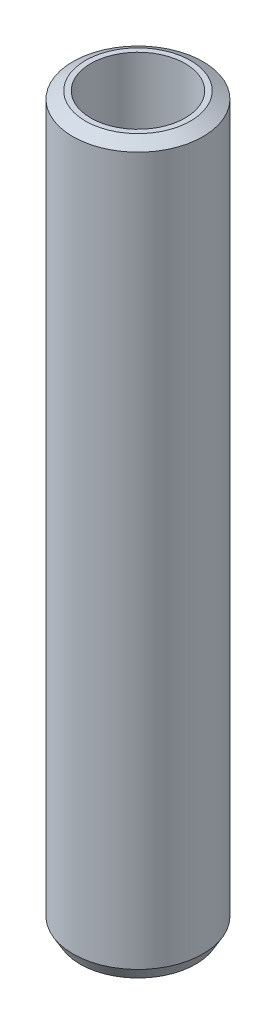
ISO-10303-21;
HEADER;
FILE_DESCRIPTION(('STEP AP214'),'2;1');
FILE_NAME('part.step','',(''),(''),'','','');
FILE_SCHEMA(('AUTOMOTIVE_DESIGN { 1 0 10303 214 1 1 1 1 }'));
ENDSEC;
DATA;
#1=APPLICATION_CONTEXT('core data for automotive mechanical design processes');
#2=APPLICATION_PROTOCOL_DEFINITION('international standard','automotive_design',2000,#1);
#3=PRODUCT_CONTEXT('',#1,'mechanical');
#4=PRODUCT('Part','Part','',(#3));
#5=PRODUCT_RELATED_PRODUCT_CATEGORY('part','',(#4));
#6=PRODUCT_DEFINITION_FORMATION('','',#4);
#7=PRODUCT_DEFINITION_CONTEXT('part definition',#1,'design');
#8=PRODUCT_DEFINITION('design','',#6,#7);
#9=PRODUCT_DEFINITION_SHAPE('','',#8);
#10=(LENGTH_UNIT() NAMED_UNIT(*) SI_UNIT(.MILLI.,.METRE.));
#11=(NAMED_UNIT(*) PLANE_ANGLE_UNIT() SI_UNIT($,.RADIAN.));
#12=(NAMED_UNIT(*) SI_UNIT($,.STERADIAN.) SOLID_ANGLE_UNIT());
#13=UNCERTAINTY_MEASURE_WITH_UNIT(LENGTH_MEASURE(1.E-05),#10,'distance_accuracy_value','');
#14=(GEOMETRIC_REPRESENTATION_CONTEXT(3) GLOBAL_UNCERTAINTY_ASSIGNED_CONTEXT((#13)) GLOBAL_UNIT_ASSIGNED_CONTEXT((#10,
#11,#12)) REPRESENTATION_CONTEXT('',''));
#15=CARTESIAN_POINT('',(0.,0.,0.));
#16=DIRECTION('',(0.,0.,1.));
#17=DIRECTION('',(1.,0.,0.));
#18=AXIS2_PLACEMENT_3D('',#15,#16,#17);
#19=CARTESIAN_POINT('',(0.,559.12420559605,0.));
#20=DIRECTION('',(0.,-1.,0.));
#21=DIRECTION('',(0.,0.,-1.));
#22=AXIS2_PLACEMENT_3D('',#19,#20,#21);
#23=CYLINDRICAL_SURFACE('',#22,50.);
#24=CARTESIAN_POINT('',(0.,553.564110897413,0.));
#25=DIRECTION('',(0.,1.,0.));
#26=DIRECTION('',(0.,0.,1.));
#27=AXIS2_PLACEMENT_3D('',#24,#25,#26);
#28=CIRCLE('',#27,50.);
#29=CARTESIAN_POINT('',(0.,553.564110897413,50.));
#30=VERTEX_POINT('',#29);
#31=EDGE_CURVE('E50',#30,#30,#28,.F.);
#32=ORIENTED_EDGE('',*,*,#31,.T.);
#33=EDGE_LOOP('',(#32));
#34=FACE_BOUND('',#33,.T.);
#35=CARTESIAN_POINT('',(0.,9.63036651293303,0.));
#36=DIRECTION('',(0.,1.,0.));
#37=DIRECTION('',(0.,0.,1.));
#38=AXIS2_PLACEMENT_3D('',#35,#36,#37);
#39=CIRCLE('',#38,50.);
#40=CARTESIAN_POINT('',(0.,9.63036651293303,50.));
#41=VERTEX_POINT('',#40);
#42=EDGE_CURVE('E51',#41,#41,#39,.T.);
#43=ORIENTED_EDGE('',*,*,#42,.T.);
#44=EDGE_LOOP('',(#43));
#45=FACE_BOUND('',#44,.T.);
#46=ADVANCED_FACE('F39',(#34,#45),#23,.T.);
#47=CARTESIAN_POINT('',(0.,559.12420559605,0.));
#48=DIRECTION('',(0.,1.,0.));
#49=DIRECTION('',(0.,0.,1.));
#50=AXIS2_PLACEMENT_3D('',#47,#48,#49);
#51=PLANE('',#50);
#52=CARTESIAN_POINT('',(0.,559.12420559605,0.));
#53=DIRECTION('',(0.,1.,0.));
#54=DIRECTION('',(0.,0.,1.));
#55=AXIS2_PLACEMENT_3D('',#52,#53,#54);
#56=CIRCLE('',#55,40.3696334870667);
#57=CARTESIAN_POINT('',(0.,559.12420559605,40.3696334870667));
#58=VERTEX_POINT('',#57);
#59=EDGE_CURVE('E54',#58,#58,#56,.T.);
#60=ORIENTED_EDGE('',*,*,#59,.T.);
#61=EDGE_LOOP('',(#60));
#62=FACE_BOUND('',#61,.T.);
#63=CARTESIAN_POINT('',(0.,559.12420559605,0.));
#64=DIRECTION('',(0.,1.,0.));
#65=DIRECTION('',(0.,0.,1.));
#66=AXIS2_PLACEMENT_3D('',#63,#64,#65);
#67=CIRCLE('',#66,36.2844619087032);
#68=CARTESIAN_POINT('',(0.,559.12420559605,36.2844619087032));
#69=VERTEX_POINT('',#68);
#70=EDGE_CURVE('E58',#69,#69,#67,.T.);
#71=ORIENTED_EDGE('',*,*,#70,.F.);
#72=EDGE_LOOP('',(#71));
#73=FACE_BOUND('',#72,.T.);
#74=ADVANCED_FACE('F69',(#62,#73),#51,.T.);
#75=CARTESIAN_POINT('',(0.,0.,0.));
#76=DIRECTION('',(0.,1.,0.));
#77=DIRECTION('',(0.,0.,1.));
#78=AXIS2_PLACEMENT_3D('',#75,#76,#77);
#79=PLANE('',#78);
#80=CARTESIAN_POINT('',(0.,0.,0.));
#81=DIRECTION('',(0.,1.,0.));
#82=DIRECTION('',(0.,0.,1.));
#83=AXIS2_PLACEMENT_3D('',#80,#81,#82);
#84=CIRCLE('',#83,44.4399053013633);
#85=CARTESIAN_POINT('',(0.,0.,44.4399053013633));
#86=VERTEX_POINT('',#85);
#87=EDGE_CURVE('E10',#86,#86,#84,.F.);
#88=ORIENTED_EDGE('',*,*,#87,.T.);
#89=EDGE_LOOP('',(#88));
#90=FACE_BOUND('',#89,.T.);
#91=CARTESIAN_POINT('',(0.,0.,0.));
#92=DIRECTION('',(0.,1.,0.));
#93=DIRECTION('',(0.,0.,1.));
#94=AXIS2_PLACEMENT_3D('',#91,#92,#93);
#95=CIRCLE('',#94,36.2844619087032);
#96=CARTESIAN_POINT('',(0.,0.,36.2844619087032));
#97=VERTEX_POINT('',#96);
#98=EDGE_CURVE('E63',#97,#97,#95,.T.);
#99=ORIENTED_EDGE('',*,*,#98,.T.);
#100=EDGE_LOOP('',(#99));
#101=FACE_BOUND('',#100,.T.);
#102=ADVANCED_FACE('F75',(#90,#101),#79,.F.);
#103=CARTESIAN_POINT('',(0.,559.12420559605,0.));
#104=DIRECTION('',(0.,-1.,0.));
#105=DIRECTION('',(0.,0.,-1.));
#106=AXIS2_PLACEMENT_3D('',#103,#104,#105);
#107=CYLINDRICAL_SURFACE('',#106,36.2844619087032);
#108=ORIENTED_EDGE('',*,*,#70,.T.);
#109=EDGE_LOOP('',(#108));
#110=FACE_BOUND('',#109,.T.);
#111=ORIENTED_EDGE('',*,*,#98,.F.);
#112=EDGE_LOOP('',(#111));
#113=FACE_BOUND('',#112,.T.);
#114=ADVANCED_FACE('F70',(#110,#113),#107,.F.);
#115=CARTESIAN_POINT('',(0.,559.12420559605,0.));
#116=DIRECTION('',(0.,-1.,0.));
#117=DIRECTION('',(0.,0.,-1.));
#118=AXIS2_PLACEMENT_3D('',#115,#116,#117);
#119=CONICAL_SURFACE('',#118,40.3696334870667,1.04719755119659);
#120=ORIENTED_EDGE('',*,*,#31,.F.);
#121=EDGE_LOOP('',(#120));
#122=FACE_BOUND('',#121,.T.);
#123=ORIENTED_EDGE('',*,*,#59,.F.);
#124=EDGE_LOOP('',(#123));
#125=FACE_BOUND('',#124,.T.);
#126=ADVANCED_FACE('F81',(#122,#125),#119,.T.);
#127=CARTESIAN_POINT('',(0.,9.63036651293303,0.));
#128=DIRECTION('',(0.,1.,0.));
#129=DIRECTION('',(0.,0.,1.));
#130=AXIS2_PLACEMENT_3D('',#127,#128,#129);
#131=CONICAL_SURFACE('',#130,50.,0.523598775598306);
#132=CARTESIAN_POINT('',(0.,0.,44.4399053013633));
#133=CARTESIAN_POINT('',(0.,0.100316317843051,44.4978229544741));
#134=CARTESIAN_POINT('',(0.,0.200632635686103,44.5557406075849));
#135=CARTESIAN_POINT('',(0.,0.401265271372208,44.6715759138065));
#136=CARTESIAN_POINT('',(0.,0.50158158921526,44.7294935669173));
#137=CARTESIAN_POINT('',(0.,0.702214224901365,44.8453288731389));
#138=CARTESIAN_POINT('',(0.,0.802530542744417,44.9032465262497));
#139=CARTESIAN_POINT('',(0.,1.00316317843052,45.0190818324713));
#140=CARTESIAN_POINT('',(0.,1.10347949627357,45.0769994855821));
#141=CARTESIAN_POINT('',(0.,1.30411213195968,45.1928347918037));
#142=CARTESIAN_POINT('',(0.,1.40442844980273,45.2507524449145));
#143=CARTESIAN_POINT('',(0.,1.60506108548884,45.3665877511361));
#144=CARTESIAN_POINT('',(0.,1.70537740333189,45.4245054042469));
#145=CARTESIAN_POINT('',(0.,1.90601003901799,45.5403407104685));
#146=CARTESIAN_POINT('',(0.,2.00632635686105,45.5982583635793));
#147=CARTESIAN_POINT('',(0.,2.20695899254715,45.7140936698009));
#148=CARTESIAN_POINT('',(0.,2.3072753103902,45.7720113229117));
#149=CARTESIAN_POINT('',(0.,2.50790794607631,45.8878466291333));
#150=CARTESIAN_POINT('',(0.,2.60822426391936,45.945764282244));
#151=CARTESIAN_POINT('',(0.,2.80885689960546,46.0615995884656));
#152=CARTESIAN_POINT('',(0.,2.90917321744852,46.1195172415764));
#153=CARTESIAN_POINT('',(0.,3.10980585313462,46.235352547798));
#154=CARTESIAN_POINT('',(0.,3.21012217097767,46.2932702009088));
#155=CARTESIAN_POINT('',(0.,3.41075480666378,46.4091055071304));
#156=CARTESIAN_POINT('',(0.,3.51107112450683,46.4670231602412));
#157=CARTESIAN_POINT('',(0.,3.71170376019294,46.5828584664628));
#158=CARTESIAN_POINT('',(0.,3.81202007803599,46.6407761195736));
#159=CARTESIAN_POINT('',(0.,4.01265271372209,46.7566114257952));
#160=CARTESIAN_POINT('',(0.,4.11296903156515,46.814529078906));
#161=CARTESIAN_POINT('',(0.,4.31360166725125,46.9303643851276));
#162=CARTESIAN_POINT('',(0.,4.4139179850943,46.9882820382384));
#163=CARTESIAN_POINT('',(0.,4.61455062078041,47.10411734446));
#164=CARTESIAN_POINT('',(0.,4.71486693862346,47.1620349975708));
#165=CARTESIAN_POINT('',(0.,4.91549957430957,47.2778703037924));
#166=CARTESIAN_POINT('',(0.,5.01581589215262,47.3357879569032));
#167=CARTESIAN_POINT('',(0.,5.21644852783872,47.4516232631248));
#168=CARTESIAN_POINT('',(0.,5.31676484568178,47.5095409162356));
#169=CARTESIAN_POINT('',(0.,5.51739748136788,47.6253762224572));
#170=CARTESIAN_POINT('',(0.,5.61771379921093,47.683293875568));
#171=CARTESIAN_POINT('',(0.,5.81834643489704,47.7991291817896));
#172=CARTESIAN_POINT('',(0.,5.91866275274009,47.8570468349004));
#173=CARTESIAN_POINT('',(0.,6.1192953884262,47.972882141122));
#174=CARTESIAN_POINT('',(0.,6.21961170626925,48.0307997942328));
#175=CARTESIAN_POINT('',(0.,6.42024434195535,48.1466351004544));
#176=CARTESIAN_POINT('',(0.,6.5205606597984,48.2045527535652));
#177=CARTESIAN_POINT('',(0.,6.72119329548451,48.3203880597868));
#178=CARTESIAN_POINT('',(0.,6.82150961332756,48.3783057128976));
#179=CARTESIAN_POINT('',(0.,7.02214224901367,48.4941410191192));
#180=CARTESIAN_POINT('',(0.,7.12245856685672,48.55205867223));
#181=CARTESIAN_POINT('',(0.,7.32309120254282,48.6678939784516));
#182=CARTESIAN_POINT('',(0.,7.42340752038588,48.7258116315624));
#183=CARTESIAN_POINT('',(0.,7.62404015607198,48.841646937784));
#184=CARTESIAN_POINT('',(0.,7.72435647391503,48.8995645908948));
#185=CARTESIAN_POINT('',(0.,7.92498910960114,49.0153998971164));
#186=CARTESIAN_POINT('',(0.,8.02530542744419,49.0733175502272));
#187=CARTESIAN_POINT('',(0.,8.22593806313029,49.1891528564488));
#188=CARTESIAN_POINT('',(0.,8.32625438097335,49.2470705095596));
#189=CARTESIAN_POINT('',(0.,8.52688701665945,49.3629058157812));
#190=CARTESIAN_POINT('',(0.,8.62720333450251,49.420823468892));
#191=CARTESIAN_POINT('',(0.,8.82783597018861,49.5366587751136));
#192=CARTESIAN_POINT('',(0.,8.92815228803166,49.5945764282244));
#193=CARTESIAN_POINT('',(0.,9.12878492371777,49.710411734446));
#194=CARTESIAN_POINT('',(0.,9.22910124156082,49.7683293875568));
#195=CARTESIAN_POINT('',(0.,9.42973387724692,49.8841646937784));
#196=CARTESIAN_POINT('',(0.,9.53005019508998,49.9420823468892));
#197=CARTESIAN_POINT('',(0.,9.63036651293303,50.));
#198=B_SPLINE_CURVE_WITH_KNOTS('',3,(#132,#133,#134,#135,#136,#137,#138,#139,#140,#141,#142,
#143,#144,#145,#146,#147,#148,#149,#150,#151,#152,#153,#154,#155,#156,#157,#158,#159,#160,#161,
#162,#163,#164,#165,#166,#167,#168,#169,#170,#171,#172,#173,#174,#175,#176,#177,#178,#179,#180,
#181,#182,#183,#184,#185,#186,#187,#188,#189,#190,#191,#192,#193,#194,#195,#196,#197),
.UNSPECIFIED.,.F.,.F.,(4,2,2,2,2,2,2,2,2,2,2,2,2,2,2,2,2,2,2,2,2,2,2,2,2,2,2,2,2,2,2,2,4),(0.,
0.347505918664791,0.695011837329583,1.04251775599437,1.39002367465917,1.73752959332396,
2.08503551198875,2.43254143065354,2.78004734931833,3.12755326798312,3.47505918664791,
3.82256510531271,4.1700710239775,4.51757694264229,4.86508286130708,5.21258877997187,
5.56009469863667,5.90760061730146,6.25510653596625,6.60261245463104,6.95011837329583,
7.29762429196062,7.64513021062542,7.99263612929021,8.340142047955,8.68764796661979,
9.03515388528458,9.38265980394937,9.73016572261417,10.077671641279,10.4251775599437,
10.7726834786085,11.1201893972733),.UNSPECIFIED.);
#199=EDGE_CURVE('BSEAM45',#86,#41,#198,.T.);
#200=ORIENTED_EDGE('',*,*,#87,.F.);
#201=ORIENTED_EDGE('',*,*,#42,.F.);
#202=ORIENTED_EDGE('',*,*,#199,.T.);
#203=ORIENTED_EDGE('',*,*,#199,.F.);
#204=EDGE_LOOP('',(#200,#202,#201,#203));
#205=FACE_BOUND('',#204,.T.);
#206=ADVANCED_FACE('F45',(#205),#131,.T.);
#207=CLOSED_SHELL('',(#46,#74,#102,#114,#126,#206));
#208=MANIFOLD_SOLID_BREP('B2',#207);
#209=ADVANCED_BREP_SHAPE_REPRESENTATION('',(#18,#208),#14);
#210=SHAPE_DEFINITION_REPRESENTATION(#9,#209);
ENDSEC;
END-ISO-10303-21;
